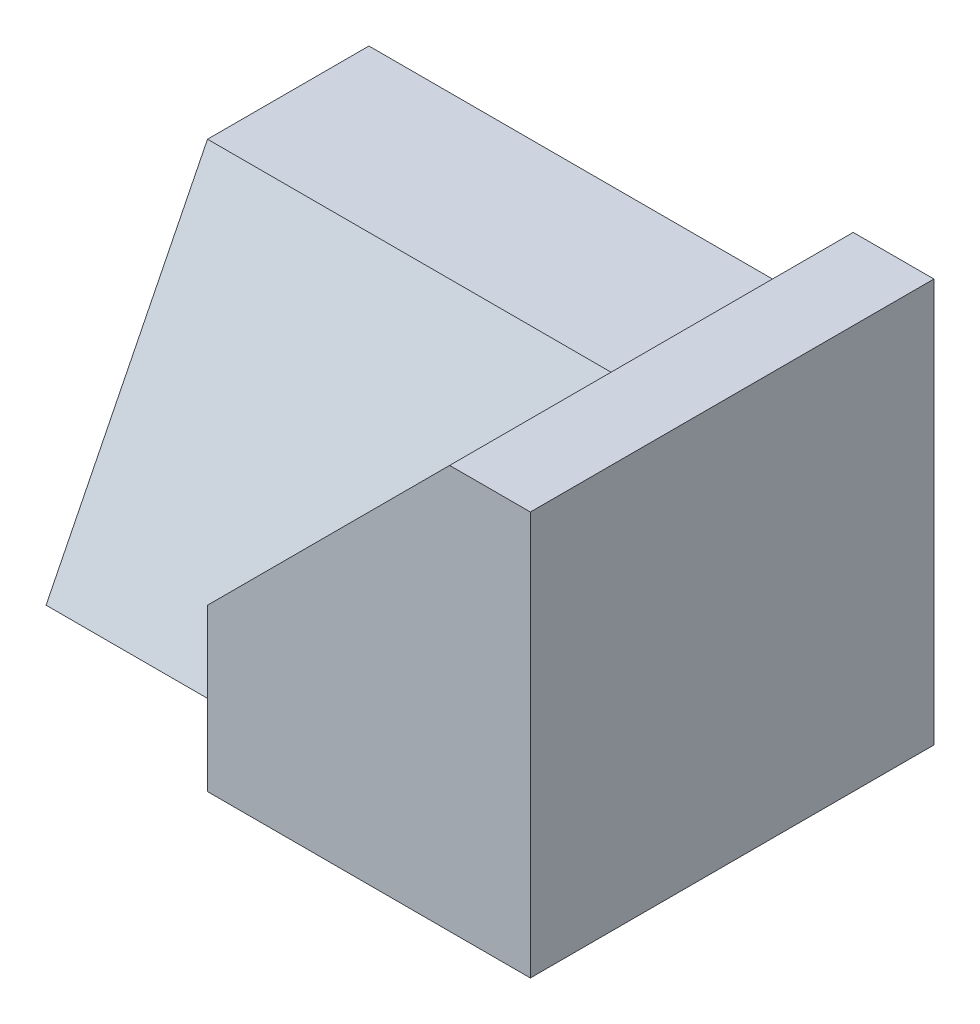
ISO-10303-21;
HEADER;
FILE_DESCRIPTION(('STEP AP214'),'2;1');
FILE_NAME('part.step','',(''),(''),'','','');
FILE_SCHEMA(('AUTOMOTIVE_DESIGN { 1 0 10303 214 1 1 1 1 }'));
ENDSEC;
DATA;
#1=APPLICATION_CONTEXT('core data for automotive mechanical design processes');
#2=APPLICATION_PROTOCOL_DEFINITION('international standard','automotive_design',2000,#1);
#3=PRODUCT_CONTEXT('',#1,'mechanical');
#4=PRODUCT('Part','Part','',(#3));
#5=PRODUCT_RELATED_PRODUCT_CATEGORY('part','',(#4));
#6=PRODUCT_DEFINITION_FORMATION('','',#4);
#7=PRODUCT_DEFINITION_CONTEXT('part definition',#1,'design');
#8=PRODUCT_DEFINITION('design','',#6,#7);
#9=PRODUCT_DEFINITION_SHAPE('','',#8);
#10=(LENGTH_UNIT() NAMED_UNIT(*) SI_UNIT(.MILLI.,.METRE.));
#11=(NAMED_UNIT(*) PLANE_ANGLE_UNIT() SI_UNIT($,.RADIAN.));
#12=(NAMED_UNIT(*) SI_UNIT($,.STERADIAN.) SOLID_ANGLE_UNIT());
#13=UNCERTAINTY_MEASURE_WITH_UNIT(LENGTH_MEASURE(1.E-05),#10,'distance_accuracy_value','');
#14=(GEOMETRIC_REPRESENTATION_CONTEXT(3) GLOBAL_UNCERTAINTY_ASSIGNED_CONTEXT((#13)) GLOBAL_UNIT_ASSIGNED_CONTEXT((#10,
#11,#12)) REPRESENTATION_CONTEXT('',''));
#15=CARTESIAN_POINT('',(0.,0.,0.));
#16=DIRECTION('',(0.,0.,1.));
#17=DIRECTION('',(1.,0.,0.));
#18=AXIS2_PLACEMENT_3D('',#15,#16,#17);
#19=CARTESIAN_POINT('',(0.,0.,50.));
#20=DIRECTION('',(1.,0.,0.));
#21=DIRECTION('',(0.,0.,-1.));
#22=AXIS2_PLACEMENT_3D('',#19,#20,#21);
#23=PLANE('',#22);
#24=DIRECTION('',(0.,0.,-1.));
#25=VECTOR('',#24,1.);
#26=CARTESIAN_POINT('',(0.,0.,50.));
#27=LINE('',#26,#25);
#28=CARTESIAN_POINT('',(0.,0.,40.));
#29=VERTEX_POINT('',#28);
#30=CARTESIAN_POINT('',(0.,0.,0.));
#31=VERTEX_POINT('',#30);
#32=EDGE_CURVE('E11',#29,#31,#27,.T.);
#33=ORIENTED_EDGE('',*,*,#32,.F.);
#34=DIRECTION('',(0.,0.894427190999916,-0.447213595499958));
#35=VECTOR('',#34,1.);
#36=CARTESIAN_POINT('',(0.,0.,40.));
#37=LINE('',#36,#35);
#38=CARTESIAN_POINT('',(0.,40.,20.));
#39=VERTEX_POINT('',#38);
#40=EDGE_CURVE('E100',#29,#39,#37,.T.);
#41=ORIENTED_EDGE('',*,*,#40,.T.);
#42=DIRECTION('',(0.,0.,1.));
#43=VECTOR('',#42,1.);
#44=CARTESIAN_POINT('',(0.,40.,0.));
#45=LINE('',#44,#43);
#46=CARTESIAN_POINT('',(0.,40.,0.));
#47=VERTEX_POINT('',#46);
#48=EDGE_CURVE('E134',#47,#39,#45,.T.);
#49=ORIENTED_EDGE('',*,*,#48,.F.);
#50=DIRECTION('',(0.,-1.,0.));
#51=VECTOR('',#50,1.);
#52=CARTESIAN_POINT('',(0.,0.,0.));
#53=LINE('',#52,#51);
#54=EDGE_CURVE('E102',#47,#31,#53,.T.);
#55=ORIENTED_EDGE('',*,*,#54,.T.);
#56=EDGE_LOOP('',(#33,#41,#49,#55));
#57=FACE_BOUND('',#56,.T.);
#58=ADVANCED_FACE('F33',(#57),#23,.F.);
#59=CARTESIAN_POINT('',(0.,0.,50.));
#60=DIRECTION('',(0.,1.,0.));
#61=DIRECTION('',(0.,0.,1.));
#62=AXIS2_PLACEMENT_3D('',#59,#60,#61);
#63=PLANE('',#62);
#64=DIRECTION('',(0.,0.,1.));
#65=VECTOR('',#64,1.);
#66=CARTESIAN_POINT('',(30.,0.,20.));
#67=LINE('',#66,#65);
#68=CARTESIAN_POINT('',(30.,0.,40.));
#69=VERTEX_POINT('',#68);
#70=CARTESIAN_POINT('',(30.,0.,50.));
#71=VERTEX_POINT('',#70);
#72=EDGE_CURVE('E110',#69,#71,#67,.T.);
#73=ORIENTED_EDGE('',*,*,#72,.F.);
#74=DIRECTION('',(-1.,0.,0.));
#75=VECTOR('',#74,1.);
#76=CARTESIAN_POINT('',(30.,0.,40.));
#77=LINE('',#76,#75);
#78=EDGE_CURVE('E107',#69,#29,#77,.T.);
#79=ORIENTED_EDGE('',*,*,#78,.T.);
#80=ORIENTED_EDGE('',*,*,#32,.T.);
#81=DIRECTION('',(1.,0.,0.));
#82=VECTOR('',#81,1.);
#83=CARTESIAN_POINT('',(0.,0.,0.));
#84=LINE('',#83,#82);
#85=CARTESIAN_POINT('',(70.,0.,0.));
#86=VERTEX_POINT('',#85);
#87=EDGE_CURVE('E152',#31,#86,#84,.T.);
#88=ORIENTED_EDGE('',*,*,#87,.T.);
#89=DIRECTION('',(0.,0.,-1.));
#90=VECTOR('',#89,1.);
#91=CARTESIAN_POINT('',(70.,0.,50.));
#92=LINE('',#91,#90);
#93=CARTESIAN_POINT('',(70.,0.,50.));
#94=VERTEX_POINT('',#93);
#95=EDGE_CURVE('E40',#94,#86,#92,.T.);
#96=ORIENTED_EDGE('',*,*,#95,.F.);
#97=DIRECTION('',(1.,0.,0.));
#98=VECTOR('',#97,1.);
#99=CARTESIAN_POINT('',(0.,0.,50.));
#100=LINE('',#99,#98);
#101=EDGE_CURVE('E142',#71,#94,#100,.T.);
#102=ORIENTED_EDGE('',*,*,#101,.F.);
#103=EDGE_LOOP('',(#73,#79,#80,#88,#96,#102));
#104=FACE_BOUND('',#103,.T.);
#105=ADVANCED_FACE('F108',(#104),#63,.F.);
#106=CARTESIAN_POINT('',(0.,0.,0.));
#107=DIRECTION('',(0.,0.,-1.));
#108=DIRECTION('',(-1.,0.,0.));
#109=AXIS2_PLACEMENT_3D('',#106,#107,#108);
#110=PLANE('',#109);
#111=ORIENTED_EDGE('',*,*,#87,.F.);
#112=ORIENTED_EDGE('',*,*,#54,.F.);
#113=DIRECTION('',(1.,0.,0.));
#114=VECTOR('',#113,1.);
#115=CARTESIAN_POINT('',(0.,40.,0.));
#116=LINE('',#115,#114);
#117=CARTESIAN_POINT('',(50.,40.,0.));
#118=VERTEX_POINT('',#117);
#119=EDGE_CURVE('E128',#47,#118,#116,.T.);
#120=ORIENTED_EDGE('',*,*,#119,.T.);
#121=DIRECTION('',(0.707106781186548,0.707106781186548,0.));
#122=VECTOR('',#121,1.);
#123=CARTESIAN_POINT('',(50.,40.,0.));
#124=LINE('',#123,#122);
#125=CARTESIAN_POINT('',(60.,50.,0.));
#126=VERTEX_POINT('',#125);
#127=EDGE_CURVE('E131',#118,#126,#124,.T.);
#128=ORIENTED_EDGE('',*,*,#127,.T.);
#129=DIRECTION('',(-1.,0.,0.));
#130=VECTOR('',#129,1.);
#131=CARTESIAN_POINT('',(0.,50.,0.));
#132=LINE('',#131,#130);
#133=CARTESIAN_POINT('',(70.,50.,0.));
#134=VERTEX_POINT('',#133);
#135=EDGE_CURVE('E145',#134,#126,#132,.T.);
#136=ORIENTED_EDGE('',*,*,#135,.F.);
#137=DIRECTION('',(0.,1.,0.));
#138=VECTOR('',#137,1.);
#139=CARTESIAN_POINT('',(70.,0.,0.));
#140=LINE('',#139,#138);
#141=EDGE_CURVE('E154',#86,#134,#140,.T.);
#142=ORIENTED_EDGE('',*,*,#141,.F.);
#143=EDGE_LOOP('',(#111,#112,#120,#128,#136,#142));
#144=FACE_BOUND('',#143,.T.);
#145=ADVANCED_FACE('F168',(#144),#110,.T.);
#146=CARTESIAN_POINT('',(50.,40.,0.));
#147=DIRECTION('',(0.707106781186548,-0.707106781186548,0.));
#148=DIRECTION('',(0.707106781186548,0.707106781186548,0.));
#149=AXIS2_PLACEMENT_3D('',#146,#147,#148);
#150=PLANE('',#149);
#151=DIRECTION('',(0.666666666666667,0.666666666666667,-0.333333333333333));
#152=VECTOR('',#151,1.);
#153=CARTESIAN_POINT('',(54.4444444444444,44.4444444444444,17.7777777777778));
#154=LINE('',#153,#152);
#155=CARTESIAN_POINT('',(30.,20.,30.));
#156=VERTEX_POINT('',#155);
#157=CARTESIAN_POINT('',(50.,40.,20.));
#158=VERTEX_POINT('',#157);
#159=EDGE_CURVE('E47',#156,#158,#154,.T.);
#160=ORIENTED_EDGE('',*,*,#159,.F.);
#161=DIRECTION('',(0.,0.,1.));
#162=VECTOR('',#161,1.);
#163=CARTESIAN_POINT('',(30.,20.,20.));
#164=LINE('',#163,#162);
#165=CARTESIAN_POINT('',(30.,20.,50.));
#166=VERTEX_POINT('',#165);
#167=EDGE_CURVE('E124',#156,#166,#164,.T.);
#168=ORIENTED_EDGE('',*,*,#167,.T.);
#169=DIRECTION('',(0.707106781186548,0.707106781186548,0.));
#170=VECTOR('',#169,1.);
#171=CARTESIAN_POINT('',(50.,40.,50.));
#172=LINE('',#171,#170);
#173=CARTESIAN_POINT('',(60.,50.,50.));
#174=VERTEX_POINT('',#173);
#175=EDGE_CURVE('E126',#166,#174,#172,.T.);
#176=ORIENTED_EDGE('',*,*,#175,.T.);
#177=DIRECTION('',(0.,0.,1.));
#178=VECTOR('',#177,1.);
#179=CARTESIAN_POINT('',(60.,50.,0.));
#180=LINE('',#179,#178);
#181=EDGE_CURVE('E136',#126,#174,#180,.T.);
#182=ORIENTED_EDGE('',*,*,#181,.F.);
#183=ORIENTED_EDGE('',*,*,#127,.F.);
#184=DIRECTION('',(0.,0.,1.));
#185=VECTOR('',#184,1.);
#186=CARTESIAN_POINT('',(50.,40.,0.));
#187=LINE('',#186,#185);
#188=EDGE_CURVE('E139',#118,#158,#187,.T.);
#189=ORIENTED_EDGE('',*,*,#188,.T.);
#190=EDGE_LOOP('',(#160,#168,#176,#182,#183,#189));
#191=FACE_BOUND('',#190,.T.);
#192=ADVANCED_FACE('F178',(#191),#150,.F.);
#193=CARTESIAN_POINT('',(30.,20.,20.));
#194=DIRECTION('',(1.,0.,0.));
#195=DIRECTION('',(0.,1.,0.));
#196=AXIS2_PLACEMENT_3D('',#193,#194,#195);
#197=PLANE('',#196);
#198=DIRECTION('',(0.,0.894427190999916,-0.447213595499958));
#199=VECTOR('',#198,1.);
#200=CARTESIAN_POINT('',(30.,24.,28.));
#201=LINE('',#200,#199);
#202=EDGE_CURVE('E113',#69,#156,#201,.T.);
#203=ORIENTED_EDGE('',*,*,#202,.F.);
#204=ORIENTED_EDGE('',*,*,#72,.T.);
#205=DIRECTION('',(0.,1.,0.));
#206=VECTOR('',#205,1.);
#207=CARTESIAN_POINT('',(30.,20.,50.));
#208=LINE('',#207,#206);
#209=EDGE_CURVE('E120',#71,#166,#208,.T.);
#210=ORIENTED_EDGE('',*,*,#209,.T.);
#211=ORIENTED_EDGE('',*,*,#167,.F.);
#212=EDGE_LOOP('',(#203,#204,#210,#211));
#213=FACE_BOUND('',#212,.T.);
#214=ADVANCED_FACE('F177',(#213),#197,.F.);
#215=CARTESIAN_POINT('',(70.,0.,50.));
#216=DIRECTION('',(-1.,0.,0.));
#217=DIRECTION('',(0.,0.,1.));
#218=AXIS2_PLACEMENT_3D('',#215,#216,#217);
#219=PLANE('',#218);
#220=ORIENTED_EDGE('',*,*,#141,.T.);
#221=DIRECTION('',(0.,0.,-1.));
#222=VECTOR('',#221,1.);
#223=CARTESIAN_POINT('',(70.,50.,50.));
#224=LINE('',#223,#222);
#225=CARTESIAN_POINT('',(70.,50.,50.));
#226=VERTEX_POINT('',#225);
#227=EDGE_CURVE('E150',#226,#134,#224,.T.);
#228=ORIENTED_EDGE('',*,*,#227,.F.);
#229=DIRECTION('',(0.,1.,0.));
#230=VECTOR('',#229,1.);
#231=CARTESIAN_POINT('',(70.,0.,50.));
#232=LINE('',#231,#230);
#233=EDGE_CURVE('E144',#94,#226,#232,.T.);
#234=ORIENTED_EDGE('',*,*,#233,.F.);
#235=ORIENTED_EDGE('',*,*,#95,.T.);
#236=EDGE_LOOP('',(#220,#228,#234,#235));
#237=FACE_BOUND('',#236,.T.);
#238=ADVANCED_FACE('F164',(#237),#219,.F.);
#239=CARTESIAN_POINT('',(0.,50.,50.));
#240=DIRECTION('',(0.,-1.,0.));
#241=DIRECTION('',(0.,0.,-1.));
#242=AXIS2_PLACEMENT_3D('',#239,#240,#241);
#243=PLANE('',#242);
#244=ORIENTED_EDGE('',*,*,#135,.T.);
#245=ORIENTED_EDGE('',*,*,#181,.T.);
#246=DIRECTION('',(-1.,0.,0.));
#247=VECTOR('',#246,1.);
#248=CARTESIAN_POINT('',(0.,50.,50.));
#249=LINE('',#248,#247);
#250=EDGE_CURVE('E147',#226,#174,#249,.T.);
#251=ORIENTED_EDGE('',*,*,#250,.F.);
#252=ORIENTED_EDGE('',*,*,#227,.T.);
#253=EDGE_LOOP('',(#244,#245,#251,#252));
#254=FACE_BOUND('',#253,.T.);
#255=ADVANCED_FACE('F170',(#254),#243,.F.);
#256=CARTESIAN_POINT('',(0.,0.,50.));
#257=DIRECTION('',(0.,0.,-1.));
#258=DIRECTION('',(-1.,0.,0.));
#259=AXIS2_PLACEMENT_3D('',#256,#257,#258);
#260=PLANE('',#259);
#261=ORIENTED_EDGE('',*,*,#175,.F.);
#262=ORIENTED_EDGE('',*,*,#209,.F.);
#263=ORIENTED_EDGE('',*,*,#101,.T.);
#264=ORIENTED_EDGE('',*,*,#233,.T.);
#265=ORIENTED_EDGE('',*,*,#250,.T.);
#266=EDGE_LOOP('',(#261,#262,#263,#264,#265));
#267=FACE_BOUND('',#266,.T.);
#268=ADVANCED_FACE('F174',(#267),#260,.F.);
#269=CARTESIAN_POINT('',(0.,40.,0.));
#270=DIRECTION('',(0.,-1.,0.));
#271=DIRECTION('',(0.,0.,-1.));
#272=AXIS2_PLACEMENT_3D('',#269,#270,#271);
#273=PLANE('',#272);
#274=ORIENTED_EDGE('',*,*,#48,.T.);
#275=DIRECTION('',(-1.,0.,0.));
#276=VECTOR('',#275,1.);
#277=CARTESIAN_POINT('',(0.,40.,20.));
#278=LINE('',#277,#276);
#279=EDGE_CURVE('E55',#158,#39,#278,.T.);
#280=ORIENTED_EDGE('',*,*,#279,.F.);
#281=ORIENTED_EDGE('',*,*,#188,.F.);
#282=ORIENTED_EDGE('',*,*,#119,.F.);
#283=EDGE_LOOP('',(#274,#280,#281,#282));
#284=FACE_BOUND('',#283,.T.);
#285=ADVANCED_FACE('F179',(#284),#273,.F.);
#286=CARTESIAN_POINT('',(0.,16.,32.));
#287=DIRECTION('',(0.,-0.447213595499958,-0.894427190999916));
#288=DIRECTION('',(0.,0.894427190999916,-0.447213595499958));
#289=AXIS2_PLACEMENT_3D('',#286,#287,#288);
#290=PLANE('',#289);
#291=ORIENTED_EDGE('',*,*,#202,.T.);
#292=ORIENTED_EDGE('',*,*,#159,.T.);
#293=ORIENTED_EDGE('',*,*,#279,.T.);
#294=ORIENTED_EDGE('',*,*,#40,.F.);
#295=ORIENTED_EDGE('',*,*,#78,.F.);
#296=EDGE_LOOP('',(#291,#292,#293,#294,#295));
#297=FACE_BOUND('',#296,.T.);
#298=ADVANCED_FACE('F115',(#297),#290,.F.);
#299=CLOSED_SHELL('',(#58,#105,#145,#192,#214,#238,#255,#268,#285,#298));
#300=MANIFOLD_SOLID_BREP('B2',#299);
#301=ADVANCED_BREP_SHAPE_REPRESENTATION('',(#18,#300),#14);
#302=SHAPE_DEFINITION_REPRESENTATION(#9,#301);
ENDSEC;
END-ISO-10303-21;
